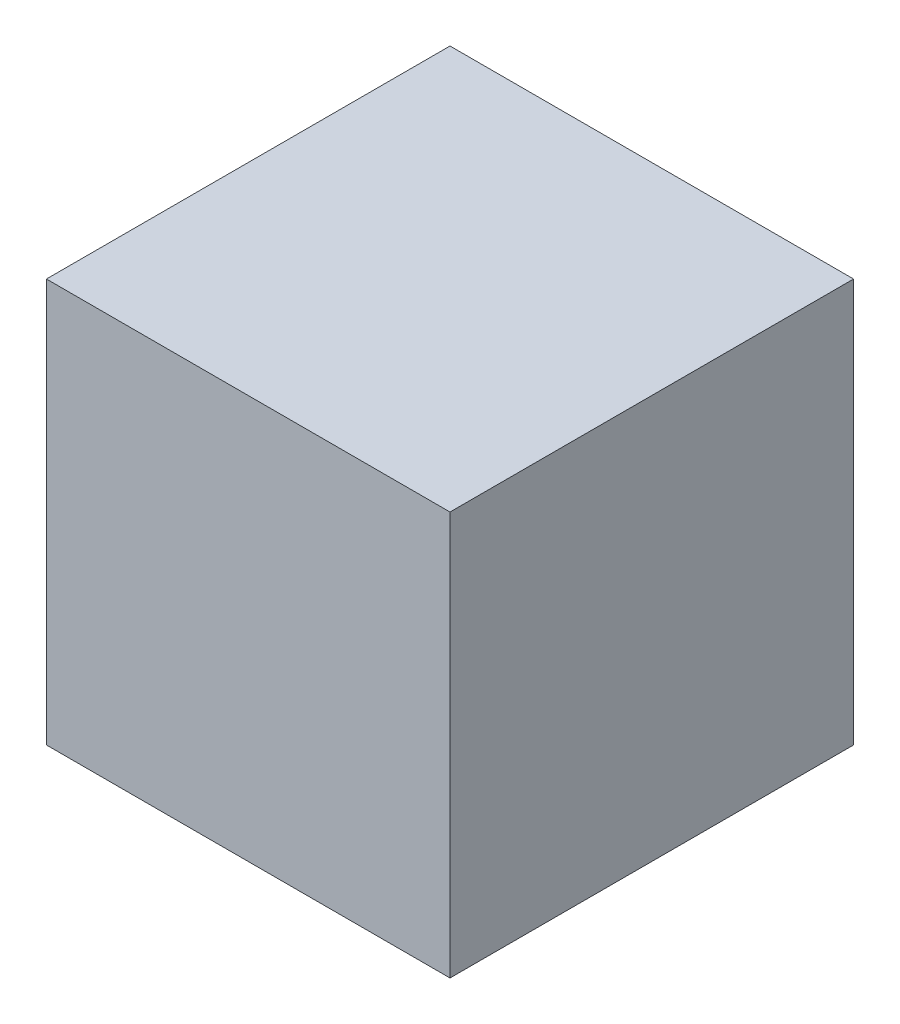
ISO-10303-21;
HEADER;
FILE_DESCRIPTION(('STEP AP214'),'2;1');
FILE_NAME('part.step','',(''),(''),'','','');
FILE_SCHEMA(('AUTOMOTIVE_DESIGN { 1 0 10303 214 1 1 1 1 }'));
ENDSEC;
DATA;
#1=APPLICATION_CONTEXT('core data for automotive mechanical design processes');
#2=APPLICATION_PROTOCOL_DEFINITION('international standard','automotive_design',2000,#1);
#3=PRODUCT_CONTEXT('',#1,'mechanical');
#4=PRODUCT('Part','Part','',(#3));
#5=PRODUCT_RELATED_PRODUCT_CATEGORY('part','',(#4));
#6=PRODUCT_DEFINITION_FORMATION('','',#4);
#7=PRODUCT_DEFINITION_CONTEXT('part definition',#1,'design');
#8=PRODUCT_DEFINITION('design','',#6,#7);
#9=PRODUCT_DEFINITION_SHAPE('','',#8);
#10=(LENGTH_UNIT() NAMED_UNIT(*) SI_UNIT(.MILLI.,.METRE.));
#11=(NAMED_UNIT(*) PLANE_ANGLE_UNIT() SI_UNIT($,.RADIAN.));
#12=(NAMED_UNIT(*) SI_UNIT($,.STERADIAN.) SOLID_ANGLE_UNIT());
#13=UNCERTAINTY_MEASURE_WITH_UNIT(LENGTH_MEASURE(1.E-05),#10,'distance_accuracy_value','');
#14=(GEOMETRIC_REPRESENTATION_CONTEXT(3) GLOBAL_UNCERTAINTY_ASSIGNED_CONTEXT((#13)) GLOBAL_UNIT_ASSIGNED_CONTEXT((#10,
#11,#12)) REPRESENTATION_CONTEXT('',''));
#15=CARTESIAN_POINT('',(0.,0.,0.));
#16=DIRECTION('',(0.,0.,1.));
#17=DIRECTION('',(1.,0.,0.));
#18=AXIS2_PLACEMENT_3D('',#15,#16,#17);
#19=CARTESIAN_POINT('',(24.,48.,24.));
#20=DIRECTION('',(-1.,0.,0.));
#21=DIRECTION('',(0.,0.,1.));
#22=AXIS2_PLACEMENT_3D('',#19,#20,#21);
#23=PLANE('',#22);
#24=DIRECTION('',(0.,0.,-1.));
#25=VECTOR('',#24,1.);
#26=CARTESIAN_POINT('',(24.,0.,24.));
#27=LINE('',#26,#25);
#28=CARTESIAN_POINT('',(24.,0.,24.));
#29=VERTEX_POINT('',#28);
#30=CARTESIAN_POINT('',(24.,0.,-24.));
#31=VERTEX_POINT('',#30);
#32=EDGE_CURVE('E97',#29,#31,#27,.T.);
#33=ORIENTED_EDGE('',*,*,#32,.T.);
#34=DIRECTION('',(0.,-1.,0.));
#35=VECTOR('',#34,1.);
#36=CARTESIAN_POINT('',(24.,48.,-24.));
#37=LINE('',#36,#35);
#38=CARTESIAN_POINT('',(24.,48.,-24.));
#39=VERTEX_POINT('',#38);
#40=EDGE_CURVE('E11',#39,#31,#37,.T.);
#41=ORIENTED_EDGE('',*,*,#40,.F.);
#42=DIRECTION('',(0.,0.,-1.));
#43=VECTOR('',#42,1.);
#44=CARTESIAN_POINT('',(24.,48.,24.));
#45=LINE('',#44,#43);
#46=CARTESIAN_POINT('',(24.,48.,24.));
#47=VERTEX_POINT('',#46);
#48=EDGE_CURVE('E85',#47,#39,#45,.T.);
#49=ORIENTED_EDGE('',*,*,#48,.F.);
#50=DIRECTION('',(0.,-1.,0.));
#51=VECTOR('',#50,1.);
#52=CARTESIAN_POINT('',(24.,48.,24.));
#53=LINE('',#52,#51);
#54=EDGE_CURVE('E93',#47,#29,#53,.T.);
#55=ORIENTED_EDGE('',*,*,#54,.T.);
#56=EDGE_LOOP('',(#33,#41,#49,#55));
#57=FACE_BOUND('',#56,.T.);
#58=ADVANCED_FACE('F34',(#57),#23,.F.);
#59=CARTESIAN_POINT('',(-24.,48.,-24.));
#60=DIRECTION('',(0.,0.,1.));
#61=DIRECTION('',(1.,0.,0.));
#62=AXIS2_PLACEMENT_3D('',#59,#60,#61);
#63=PLANE('',#62);
#64=DIRECTION('',(-1.,0.,0.));
#65=VECTOR('',#64,1.);
#66=CARTESIAN_POINT('',(-24.,0.,-24.));
#67=LINE('',#66,#65);
#68=CARTESIAN_POINT('',(-24.,0.,-24.));
#69=VERTEX_POINT('',#68);
#70=EDGE_CURVE('E89',#31,#69,#67,.T.);
#71=ORIENTED_EDGE('',*,*,#70,.T.);
#72=DIRECTION('',(0.,-1.,0.));
#73=VECTOR('',#72,1.);
#74=CARTESIAN_POINT('',(-24.,48.,-24.));
#75=LINE('',#74,#73);
#76=CARTESIAN_POINT('',(-24.,48.,-24.));
#77=VERTEX_POINT('',#76);
#78=EDGE_CURVE('E42',#77,#69,#75,.T.);
#79=ORIENTED_EDGE('',*,*,#78,.F.);
#80=DIRECTION('',(-1.,0.,0.));
#81=VECTOR('',#80,1.);
#82=CARTESIAN_POINT('',(-24.,48.,-24.));
#83=LINE('',#82,#81);
#84=EDGE_CURVE('E80',#39,#77,#83,.T.);
#85=ORIENTED_EDGE('',*,*,#84,.F.);
#86=ORIENTED_EDGE('',*,*,#40,.T.);
#87=EDGE_LOOP('',(#71,#79,#85,#86));
#88=FACE_BOUND('',#87,.T.);
#89=ADVANCED_FACE('F88',(#88),#63,.F.);
#90=CARTESIAN_POINT('',(-24.,48.,24.));
#91=DIRECTION('',(1.,0.,0.));
#92=DIRECTION('',(0.,0.,-1.));
#93=AXIS2_PLACEMENT_3D('',#90,#91,#92);
#94=PLANE('',#93);
#95=DIRECTION('',(0.,0.,1.));
#96=VECTOR('',#95,1.);
#97=CARTESIAN_POINT('',(-24.,0.,24.));
#98=LINE('',#97,#96);
#99=CARTESIAN_POINT('',(-24.,0.,24.));
#100=VERTEX_POINT('',#99);
#101=EDGE_CURVE('E67',#69,#100,#98,.T.);
#102=ORIENTED_EDGE('',*,*,#101,.T.);
#103=DIRECTION('',(0.,-1.,0.));
#104=VECTOR('',#103,1.);
#105=CARTESIAN_POINT('',(-24.,48.,24.));
#106=LINE('',#105,#104);
#107=CARTESIAN_POINT('',(-24.,48.,24.));
#108=VERTEX_POINT('',#107);
#109=EDGE_CURVE('E90',#108,#100,#106,.T.);
#110=ORIENTED_EDGE('',*,*,#109,.F.);
#111=DIRECTION('',(0.,0.,1.));
#112=VECTOR('',#111,1.);
#113=CARTESIAN_POINT('',(-24.,48.,24.));
#114=LINE('',#113,#112);
#115=EDGE_CURVE('E83',#77,#108,#114,.T.);
#116=ORIENTED_EDGE('',*,*,#115,.F.);
#117=ORIENTED_EDGE('',*,*,#78,.T.);
#118=EDGE_LOOP('',(#102,#110,#116,#117));
#119=FACE_BOUND('',#118,.T.);
#120=ADVANCED_FACE('F91',(#119),#94,.F.);
#121=CARTESIAN_POINT('',(-24.,48.,24.));
#122=DIRECTION('',(0.,0.,-1.));
#123=DIRECTION('',(-1.,0.,0.));
#124=AXIS2_PLACEMENT_3D('',#121,#122,#123);
#125=PLANE('',#124);
#126=DIRECTION('',(1.,0.,0.));
#127=VECTOR('',#126,1.);
#128=CARTESIAN_POINT('',(-24.,0.,24.));
#129=LINE('',#128,#127);
#130=EDGE_CURVE('E73',#100,#29,#129,.T.);
#131=ORIENTED_EDGE('',*,*,#130,.T.);
#132=ORIENTED_EDGE('',*,*,#54,.F.);
#133=DIRECTION('',(1.,0.,0.));
#134=VECTOR('',#133,1.);
#135=CARTESIAN_POINT('',(-24.,48.,24.));
#136=LINE('',#135,#134);
#137=EDGE_CURVE('E50',#108,#47,#136,.T.);
#138=ORIENTED_EDGE('',*,*,#137,.F.);
#139=ORIENTED_EDGE('',*,*,#109,.T.);
#140=EDGE_LOOP('',(#131,#132,#138,#139));
#141=FACE_BOUND('',#140,.T.);
#142=ADVANCED_FACE('F104',(#141),#125,.F.);
#143=CARTESIAN_POINT('',(24.,48.,-24.));
#144=DIRECTION('',(0.,-1.,0.));
#145=DIRECTION('',(0.,0.,-1.));
#146=AXIS2_PLACEMENT_3D('',#143,#144,#145);
#147=PLANE('',#146);
#148=ORIENTED_EDGE('',*,*,#48,.T.);
#149=ORIENTED_EDGE('',*,*,#84,.T.);
#150=ORIENTED_EDGE('',*,*,#115,.T.);
#151=ORIENTED_EDGE('',*,*,#137,.T.);
#152=EDGE_LOOP('',(#148,#149,#150,#151));
#153=FACE_BOUND('',#152,.T.);
#154=ADVANCED_FACE('F81',(#153),#147,.F.);
#155=CARTESIAN_POINT('',(24.,0.,-24.));
#156=DIRECTION('',(0.,-1.,0.));
#157=DIRECTION('',(0.,0.,-1.));
#158=AXIS2_PLACEMENT_3D('',#155,#156,#157);
#159=PLANE('',#158);
#160=ORIENTED_EDGE('',*,*,#32,.F.);
#161=ORIENTED_EDGE('',*,*,#130,.F.);
#162=ORIENTED_EDGE('',*,*,#101,.F.);
#163=ORIENTED_EDGE('',*,*,#70,.F.);
#164=EDGE_LOOP('',(#160,#161,#162,#163));
#165=FACE_BOUND('',#164,.T.);
#166=ADVANCED_FACE('F107',(#165),#159,.T.);
#167=CLOSED_SHELL('',(#58,#89,#120,#142,#154,#166));
#168=MANIFOLD_SOLID_BREP('B2',#167);
#169=ADVANCED_BREP_SHAPE_REPRESENTATION('',(#18,#168),#14);
#170=SHAPE_DEFINITION_REPRESENTATION(#9,#169);
ENDSEC;
END-ISO-10303-21;
